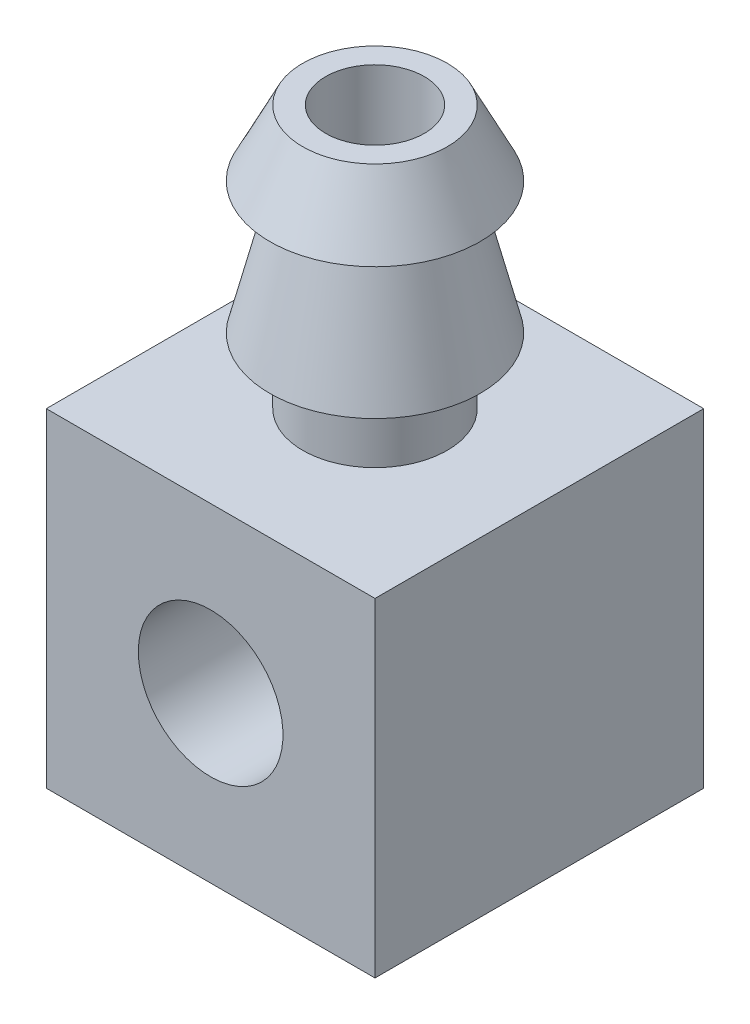
ISO-10303-21;
HEADER;
FILE_DESCRIPTION(('STEP AP214'),'2;1');
FILE_NAME('part.step','',(''),(''),'','','');
FILE_SCHEMA(('AUTOMOTIVE_DESIGN { 1 0 10303 214 1 1 1 1 }'));
ENDSEC;
DATA;
#1=APPLICATION_CONTEXT('core data for automotive mechanical design processes');
#2=APPLICATION_PROTOCOL_DEFINITION('international standard','automotive_design',2000,#1);
#3=PRODUCT_CONTEXT('',#1,'mechanical');
#4=PRODUCT('Part','Part','',(#3));
#5=PRODUCT_RELATED_PRODUCT_CATEGORY('part','',(#4));
#6=PRODUCT_DEFINITION_FORMATION('','',#4);
#7=PRODUCT_DEFINITION_CONTEXT('part definition',#1,'design');
#8=PRODUCT_DEFINITION('design','',#6,#7);
#9=PRODUCT_DEFINITION_SHAPE('','',#8);
#10=(LENGTH_UNIT() NAMED_UNIT(*) SI_UNIT(.MILLI.,.METRE.));
#11=(NAMED_UNIT(*) PLANE_ANGLE_UNIT() SI_UNIT($,.RADIAN.));
#12=(NAMED_UNIT(*) SI_UNIT($,.STERADIAN.) SOLID_ANGLE_UNIT());
#13=UNCERTAINTY_MEASURE_WITH_UNIT(LENGTH_MEASURE(1.E-05),#10,'distance_accuracy_value','');
#14=(GEOMETRIC_REPRESENTATION_CONTEXT(3) GLOBAL_UNCERTAINTY_ASSIGNED_CONTEXT((#13)) GLOBAL_UNIT_ASSIGNED_CONTEXT((#10,
#11,#12)) REPRESENTATION_CONTEXT('',''));
#15=CARTESIAN_POINT('',(0.,0.,0.));
#16=DIRECTION('',(0.,0.,1.));
#17=DIRECTION('',(1.,0.,0.));
#18=AXIS2_PLACEMENT_3D('',#15,#16,#17);
#19=CARTESIAN_POINT('',(2.5,-2.5,5.));
#20=DIRECTION('',(-1.,0.,0.));
#21=DIRECTION('',(0.,0.,1.));
#22=AXIS2_PLACEMENT_3D('',#19,#20,#21);
#23=PLANE('',#22);
#24=DIRECTION('',(0.,1.,0.));
#25=VECTOR('',#24,1.);
#26=CARTESIAN_POINT('',(2.5,-2.5,0.));
#27=LINE('',#26,#25);
#28=CARTESIAN_POINT('',(2.5,-2.5,0.));
#29=VERTEX_POINT('',#28);
#30=CARTESIAN_POINT('',(2.5,2.5,0.));
#31=VERTEX_POINT('',#30);
#32=EDGE_CURVE('E114',#29,#31,#27,.T.);
#33=ORIENTED_EDGE('',*,*,#32,.T.);
#34=DIRECTION('',(0.,0.,-1.));
#35=VECTOR('',#34,1.);
#36=CARTESIAN_POINT('',(2.5,2.5,5.));
#37=LINE('',#36,#35);
#38=CARTESIAN_POINT('',(2.5,2.5,5.));
#39=VERTEX_POINT('',#38);
#40=EDGE_CURVE('E11',#39,#31,#37,.T.);
#41=ORIENTED_EDGE('',*,*,#40,.F.);
#42=DIRECTION('',(0.,1.,0.));
#43=VECTOR('',#42,1.);
#44=CARTESIAN_POINT('',(2.5,-2.5,5.));
#45=LINE('',#44,#43);
#46=CARTESIAN_POINT('',(2.5,-2.5,5.));
#47=VERTEX_POINT('',#46);
#48=EDGE_CURVE('E97',#47,#39,#45,.T.);
#49=ORIENTED_EDGE('',*,*,#48,.F.);
#50=DIRECTION('',(0.,0.,-1.));
#51=VECTOR('',#50,1.);
#52=CARTESIAN_POINT('',(2.5,-2.5,5.));
#53=LINE('',#52,#51);
#54=EDGE_CURVE('E110',#47,#29,#53,.T.);
#55=ORIENTED_EDGE('',*,*,#54,.T.);
#56=EDGE_LOOP('',(#33,#41,#49,#55));
#57=FACE_BOUND('',#56,.T.);
#58=ADVANCED_FACE('F38',(#57),#23,.F.);
#59=CARTESIAN_POINT('',(-2.5,2.5,5.));
#60=DIRECTION('',(0.,-1.,0.));
#61=DIRECTION('',(0.,0.,-1.));
#62=AXIS2_PLACEMENT_3D('',#59,#60,#61);
#63=PLANE('',#62);
#64=CARTESIAN_POINT('',(0.,2.5,2.5));
#65=DIRECTION('',(0.,-1.,0.));
#66=DIRECTION('',(0.,0.,-1.));
#67=AXIS2_PLACEMENT_3D('',#64,#65,#66);
#68=CIRCLE('',#67,1.1);
#69=CARTESIAN_POINT('',(0.,2.5,1.4));
#70=VERTEX_POINT('',#69);
#71=EDGE_CURVE('E118',#70,#70,#68,.T.);
#72=ORIENTED_EDGE('',*,*,#71,.T.);
#73=EDGE_LOOP('',(#72));
#74=FACE_BOUND('',#73,.T.);
#75=DIRECTION('',(-1.,0.,0.));
#76=VECTOR('',#75,1.);
#77=CARTESIAN_POINT('',(-2.5,2.5,0.));
#78=LINE('',#77,#76);
#79=CARTESIAN_POINT('',(-2.5,2.5,0.));
#80=VERTEX_POINT('',#79);
#81=EDGE_CURVE('E102',#31,#80,#78,.T.);
#82=ORIENTED_EDGE('',*,*,#81,.T.);
#83=DIRECTION('',(0.,0.,-1.));
#84=VECTOR('',#83,1.);
#85=CARTESIAN_POINT('',(-2.5,2.5,5.));
#86=LINE('',#85,#84);
#87=CARTESIAN_POINT('',(-2.5,2.5,5.));
#88=VERTEX_POINT('',#87);
#89=EDGE_CURVE('E53',#88,#80,#86,.T.);
#90=ORIENTED_EDGE('',*,*,#89,.F.);
#91=DIRECTION('',(-1.,0.,0.));
#92=VECTOR('',#91,1.);
#93=CARTESIAN_POINT('',(-2.5,2.5,5.));
#94=LINE('',#93,#92);
#95=EDGE_CURVE('E92',#39,#88,#94,.T.);
#96=ORIENTED_EDGE('',*,*,#95,.F.);
#97=ORIENTED_EDGE('',*,*,#40,.T.);
#98=EDGE_LOOP('',(#82,#90,#96,#97));
#99=FACE_BOUND('',#98,.T.);
#100=ADVANCED_FACE('F101',(#74,#99),#63,.F.);
#101=CARTESIAN_POINT('',(-2.5,-2.5,5.));
#102=DIRECTION('',(1.,0.,0.));
#103=DIRECTION('',(0.,0.,-1.));
#104=AXIS2_PLACEMENT_3D('',#101,#102,#103);
#105=PLANE('',#104);
#106=DIRECTION('',(0.,-1.,0.));
#107=VECTOR('',#106,1.);
#108=CARTESIAN_POINT('',(-2.5,-2.5,0.));
#109=LINE('',#108,#107);
#110=CARTESIAN_POINT('',(-2.5,-2.5,0.));
#111=VERTEX_POINT('',#110);
#112=EDGE_CURVE('E79',#80,#111,#109,.T.);
#113=ORIENTED_EDGE('',*,*,#112,.T.);
#114=DIRECTION('',(0.,0.,-1.));
#115=VECTOR('',#114,1.);
#116=CARTESIAN_POINT('',(-2.5,-2.5,5.));
#117=LINE('',#116,#115);
#118=CARTESIAN_POINT('',(-2.5,-2.5,5.));
#119=VERTEX_POINT('',#118);
#120=EDGE_CURVE('E104',#119,#111,#117,.T.);
#121=ORIENTED_EDGE('',*,*,#120,.F.);
#122=DIRECTION('',(0.,-1.,0.));
#123=VECTOR('',#122,1.);
#124=CARTESIAN_POINT('',(-2.5,-2.5,5.));
#125=LINE('',#124,#123);
#126=EDGE_CURVE('E95',#88,#119,#125,.T.);
#127=ORIENTED_EDGE('',*,*,#126,.F.);
#128=ORIENTED_EDGE('',*,*,#89,.T.);
#129=EDGE_LOOP('',(#113,#121,#127,#128));
#130=FACE_BOUND('',#129,.T.);
#131=ADVANCED_FACE('F106',(#130),#105,.F.);
#132=CARTESIAN_POINT('',(-2.5,-2.5,5.));
#133=DIRECTION('',(0.,1.,0.));
#134=DIRECTION('',(0.,0.,1.));
#135=AXIS2_PLACEMENT_3D('',#132,#133,#134);
#136=PLANE('',#135);
#137=DIRECTION('',(1.,0.,0.));
#138=VECTOR('',#137,1.);
#139=CARTESIAN_POINT('',(-2.5,-2.5,0.));
#140=LINE('',#139,#138);
#141=EDGE_CURVE('E85',#111,#29,#140,.T.);
#142=ORIENTED_EDGE('',*,*,#141,.T.);
#143=ORIENTED_EDGE('',*,*,#54,.F.);
#144=DIRECTION('',(1.,0.,0.));
#145=VECTOR('',#144,1.);
#146=CARTESIAN_POINT('',(-2.5,-2.5,5.));
#147=LINE('',#146,#145);
#148=EDGE_CURVE('E62',#119,#47,#147,.T.);
#149=ORIENTED_EDGE('',*,*,#148,.F.);
#150=ORIENTED_EDGE('',*,*,#120,.T.);
#151=EDGE_LOOP('',(#142,#143,#149,#150));
#152=FACE_BOUND('',#151,.T.);
#153=ADVANCED_FACE('F173',(#152),#136,.F.);
#154=CARTESIAN_POINT('',(0.,0.,5.));
#155=DIRECTION('',(0.,0.,-1.));
#156=DIRECTION('',(-1.,0.,0.));
#157=AXIS2_PLACEMENT_3D('',#154,#155,#156);
#158=PLANE('',#157);
#159=CARTESIAN_POINT('',(0.,0.,5.));
#160=DIRECTION('',(0.,0.,-1.));
#161=DIRECTION('',(-1.,0.,0.));
#162=AXIS2_PLACEMENT_3D('',#159,#160,#161);
#163=CIRCLE('',#162,1.1);
#164=CARTESIAN_POINT('',(-1.1,0.,5.));
#165=VERTEX_POINT('',#164);
#166=EDGE_CURVE('E326',#165,#165,#163,.T.);
#167=ORIENTED_EDGE('',*,*,#166,.T.);
#168=EDGE_LOOP('',(#167));
#169=FACE_BOUND('',#168,.T.);
#170=ORIENTED_EDGE('',*,*,#48,.T.);
#171=ORIENTED_EDGE('',*,*,#95,.T.);
#172=ORIENTED_EDGE('',*,*,#126,.T.);
#173=ORIENTED_EDGE('',*,*,#148,.T.);
#174=EDGE_LOOP('',(#170,#171,#172,#173));
#175=FACE_BOUND('',#174,.T.);
#176=ADVANCED_FACE('F93',(#169,#175),#158,.F.);
#177=CARTESIAN_POINT('',(0.,0.,0.));
#178=DIRECTION('',(0.,0.,-1.));
#179=DIRECTION('',(-1.,0.,0.));
#180=AXIS2_PLACEMENT_3D('',#177,#178,#179);
#181=PLANE('',#180);
#182=CARTESIAN_POINT('',(0.,0.,0.));
#183=DIRECTION('',(0.,0.,-1.));
#184=DIRECTION('',(-1.,0.,0.));
#185=AXIS2_PLACEMENT_3D('',#182,#183,#184);
#186=CIRCLE('',#185,1.1);
#187=CARTESIAN_POINT('',(-1.1,0.,0.));
#188=VERTEX_POINT('',#187);
#189=EDGE_CURVE('E134',#188,#188,#186,.T.);
#190=ORIENTED_EDGE('',*,*,#189,.F.);
#191=EDGE_LOOP('',(#190));
#192=FACE_BOUND('',#191,.T.);
#193=ORIENTED_EDGE('',*,*,#32,.F.);
#194=ORIENTED_EDGE('',*,*,#141,.F.);
#195=ORIENTED_EDGE('',*,*,#112,.F.);
#196=ORIENTED_EDGE('',*,*,#81,.F.);
#197=EDGE_LOOP('',(#193,#194,#195,#196));
#198=FACE_BOUND('',#197,.T.);
#199=ADVANCED_FACE('F161',(#192,#198),#181,.T.);
#200=CARTESIAN_POINT('',(0.,2.5,2.5));
#201=DIRECTION('',(0.,-1.,0.));
#202=DIRECTION('',(0.,0.,-1.));
#203=AXIS2_PLACEMENT_3D('',#200,#201,#202);
#204=CYLINDRICAL_SURFACE('',#203,1.1);
#205=ORIENTED_EDGE('',*,*,#71,.F.);
#206=EDGE_LOOP('',(#205));
#207=FACE_BOUND('',#206,.T.);
#208=CARTESIAN_POINT('',(0.,3.5,2.5));
#209=DIRECTION('',(0.,-1.,0.));
#210=DIRECTION('',(0.,0.,-1.));
#211=AXIS2_PLACEMENT_3D('',#208,#209,#210);
#212=CIRCLE('',#211,1.1);
#213=CARTESIAN_POINT('',(0.,3.5,1.4));
#214=VERTEX_POINT('',#213);
#215=EDGE_CURVE('E294',#214,#214,#212,.T.);
#216=ORIENTED_EDGE('',*,*,#215,.T.);
#217=EDGE_LOOP('',(#216));
#218=FACE_BOUND('',#217,.T.);
#219=ADVANCED_FACE('F163',(#207,#218),#204,.T.);
#220=CARTESIAN_POINT('',(0.,3.5,3.6));
#221=DIRECTION('',(0.,1.,0.));
#222=DIRECTION('',(0.,0.,1.));
#223=AXIS2_PLACEMENT_3D('',#220,#221,#222);
#224=PLANE('',#223);
#225=ORIENTED_EDGE('',*,*,#215,.F.);
#226=EDGE_LOOP('',(#225));
#227=FACE_BOUND('',#226,.T.);
#228=CARTESIAN_POINT('',(0.,3.5,2.5));
#229=DIRECTION('',(0.,-1.,0.));
#230=DIRECTION('',(0.,0.,-1.));
#231=AXIS2_PLACEMENT_3D('',#228,#229,#230);
#232=CIRCLE('',#231,1.6);
#233=CARTESIAN_POINT('',(0.,3.5,0.900000000000001));
#234=VERTEX_POINT('',#233);
#235=EDGE_CURVE('E297',#234,#234,#232,.T.);
#236=ORIENTED_EDGE('',*,*,#235,.T.);
#237=EDGE_LOOP('',(#236));
#238=FACE_BOUND('',#237,.T.);
#239=ADVANCED_FACE('F170',(#227,#238),#224,.F.);
#240=CARTESIAN_POINT('',(0.,5.5,2.5));
#241=DIRECTION('',(0.,-1.,0.));
#242=DIRECTION('',(0.,0.,-1.));
#243=AXIS2_PLACEMENT_3D('',#240,#241,#242);
#244=CONICAL_SURFACE('',#243,1.1,0.244978663126864);
#245=ORIENTED_EDGE('',*,*,#235,.F.);
#246=EDGE_LOOP('',(#245));
#247=FACE_BOUND('',#246,.T.);
#248=CARTESIAN_POINT('',(0.,5.5,2.5));
#249=DIRECTION('',(0.,-1.,0.));
#250=DIRECTION('',(0.,0.,-1.));
#251=AXIS2_PLACEMENT_3D('',#248,#249,#250);
#252=CIRCLE('',#251,1.1);
#253=CARTESIAN_POINT('',(0.,5.5,1.4));
#254=VERTEX_POINT('',#253);
#255=EDGE_CURVE('E299',#254,#254,#252,.T.);
#256=ORIENTED_EDGE('',*,*,#255,.T.);
#257=EDGE_LOOP('',(#256));
#258=FACE_BOUND('',#257,.T.);
#259=ADVANCED_FACE('F246',(#247,#258),#244,.T.);
#260=CARTESIAN_POINT('',(0.,5.5,3.6));
#261=DIRECTION('',(0.,1.,0.));
#262=DIRECTION('',(0.,0.,1.));
#263=AXIS2_PLACEMENT_3D('',#260,#261,#262);
#264=PLANE('',#263);
#265=ORIENTED_EDGE('',*,*,#255,.F.);
#266=EDGE_LOOP('',(#265));
#267=FACE_BOUND('',#266,.T.);
#268=CARTESIAN_POINT('',(0.,5.5,2.5));
#269=DIRECTION('',(0.,-1.,0.));
#270=DIRECTION('',(0.,0.,-1.));
#271=AXIS2_PLACEMENT_3D('',#268,#269,#270);
#272=CIRCLE('',#271,1.6);
#273=CARTESIAN_POINT('',(0.,5.5,0.900000000000001));
#274=VERTEX_POINT('',#273);
#275=EDGE_CURVE('E305',#274,#274,#272,.T.);
#276=ORIENTED_EDGE('',*,*,#275,.T.);
#277=EDGE_LOOP('',(#276));
#278=FACE_BOUND('',#277,.T.);
#279=ADVANCED_FACE('F238',(#267,#278),#264,.F.);
#280=CARTESIAN_POINT('',(0.,6.5,2.5));
#281=DIRECTION('',(0.,-1.,0.));
#282=DIRECTION('',(0.,0.,-1.));
#283=AXIS2_PLACEMENT_3D('',#280,#281,#282);
#284=CONICAL_SURFACE('',#283,1.1,0.463647609000805);
#285=ORIENTED_EDGE('',*,*,#275,.F.);
#286=EDGE_LOOP('',(#285));
#287=FACE_BOUND('',#286,.T.);
#288=CARTESIAN_POINT('',(0.,6.5,2.5));
#289=DIRECTION('',(0.,-1.,0.));
#290=DIRECTION('',(0.,0.,-1.));
#291=AXIS2_PLACEMENT_3D('',#288,#289,#290);
#292=CIRCLE('',#291,1.1);
#293=CARTESIAN_POINT('',(0.,6.5,1.4));
#294=VERTEX_POINT('',#293);
#295=EDGE_CURVE('E317',#294,#294,#292,.T.);
#296=ORIENTED_EDGE('',*,*,#295,.T.);
#297=EDGE_LOOP('',(#296));
#298=FACE_BOUND('',#297,.T.);
#299=ADVANCED_FACE('F232',(#287,#298),#284,.T.);
#300=CARTESIAN_POINT('',(0.,6.5,3.6));
#301=DIRECTION('',(0.,-1.,0.));
#302=DIRECTION('',(0.,0.,-1.));
#303=AXIS2_PLACEMENT_3D('',#300,#301,#302);
#304=PLANE('',#303);
#305=CARTESIAN_POINT('',(0.,6.5,2.5));
#306=DIRECTION('',(0.,1.,0.));
#307=DIRECTION('',(0.,0.,1.));
#308=AXIS2_PLACEMENT_3D('',#305,#306,#307);
#309=CIRCLE('',#308,0.75);
#310=CARTESIAN_POINT('',(0.,6.5,3.25));
#311=VERTEX_POINT('',#310);
#312=EDGE_CURVE('E322',#311,#311,#309,.T.);
#313=ORIENTED_EDGE('',*,*,#312,.F.);
#314=EDGE_LOOP('',(#313));
#315=FACE_BOUND('',#314,.T.);
#316=ORIENTED_EDGE('',*,*,#295,.F.);
#317=EDGE_LOOP('',(#316));
#318=FACE_BOUND('',#317,.T.);
#319=ADVANCED_FACE('F210',(#315,#318),#304,.F.);
#320=CARTESIAN_POINT('',(0.,-1.5,2.5));
#321=DIRECTION('',(0.,1.,0.));
#322=DIRECTION('',(0.,0.,1.));
#323=AXIS2_PLACEMENT_3D('',#320,#321,#322);
#324=CYLINDRICAL_SURFACE('',#323,0.75);
#325=CARTESIAN_POINT('',(0.,1.1,3.25));
#326=CARTESIAN_POINT('',(-0.0374973618435636,1.09999938293257,3.24999938085178));
#327=CARTESIAN_POINT('',(-0.0750006983033402,1.0980656841688,3.24717158695474));
#328=CARTESIAN_POINT('',(-0.148809307319852,1.09052040847244,3.23603746242082));
#329=CARTESIAN_POINT('',(-0.185113791763276,1.08490646082127,3.22772760035938));
#330=CARTESIAN_POINT('',(-0.255339480227532,1.07055194303432,3.20614859177342));
#331=CARTESIAN_POINT('',(-0.289271346524591,1.06182660228419,3.1929035874333));
#332=CARTESIAN_POINT('',(-0.354280663545986,1.04194163845303,3.16202844433174));
#333=CARTESIAN_POINT('',(-0.385357777109188,1.03078172836065,3.14439778851151));
#334=CARTESIAN_POINT('',(-0.446815124010501,1.00575842595247,3.10359970810546));
#335=CARTESIAN_POINT('',(-0.476902425905368,0.991744667816341,3.0800852190035));
#336=CARTESIAN_POINT('',(-0.532979258672838,0.962772917104335,3.02903109089334));
#337=CARTESIAN_POINT('',(-0.558962666980862,0.947813559490814,3.00148555376525));
#338=CARTESIAN_POINT('',(-0.610512939998384,0.91561009893895,2.93785834631726));
#339=CARTESIAN_POINT('',(-0.63529418742601,0.898399088401743,2.90111875458135));
#340=CARTESIAN_POINT('',(-0.678319864138517,0.866372319671299,2.82304845447361));
#341=CARTESIAN_POINT('',(-0.696575511127502,0.851552475293575,2.78172578638737));
#342=CARTESIAN_POINT('',(-0.721266133434853,0.830635302613014,2.70808290883474));
#343=CARTESIAN_POINT('',(-0.72960363544879,0.823254885814258,2.67676907904842));
#344=CARTESIAN_POINT('',(-0.742190921414966,0.811927298608613,2.61274913340042));
#345=CARTESIAN_POINT('',(-0.746448129102549,0.807973894312688,2.58004565956924));
#346=CARTESIAN_POINT('',(-0.750603641026167,0.80411667724191,2.51395440870222));
#347=CARTESIAN_POINT('',(-0.750480991500712,0.804232331290621,2.48056410615158));
#348=CARTESIAN_POINT('',(-0.745833531000593,0.808542559338197,2.41435091856944));
#349=CARTESIAN_POINT('',(-0.741305538687807,0.812740081075134,2.38152846104459));
#350=CARTESIAN_POINT('',(-0.728518426307483,0.824213796265676,2.31910497038377));
#351=CARTESIAN_POINT('',(-0.720472367897711,0.831312859651301,2.28942557105893));
#352=CARTESIAN_POINT('',(-0.701074384206606,0.847735928983881,2.2318210125113));
#353=CARTESIAN_POINT('',(-0.689719890791399,0.85706166233805,2.20389723662011));
#354=CARTESIAN_POINT('',(-0.65766593076382,0.88208006420814,2.13673275965807));
#355=CARTESIAN_POINT('',(-0.635118465657243,0.898645977676744,2.0986941755742));
#356=CARTESIAN_POINT('',(-0.583971643099367,0.93269760499413,2.0273382511863));
#357=CARTESIAN_POINT('',(-0.555360942293804,0.950184996053266,1.99402995834866));
#358=CARTESIAN_POINT('',(-0.492209599084743,0.984394048040352,1.93237976245778));
#359=CARTESIAN_POINT('',(-0.457618338007022,1.00110748723771,1.90408480986919));
#360=CARTESIAN_POINT('',(-0.383173827118671,1.03188748645417,1.85371208007581));
#361=CARTESIAN_POINT('',(-0.343331707806251,1.04595949679029,1.83162145305169));
#362=CARTESIAN_POINT('',(-0.268573382676514,1.06725247983133,1.7988255701354));
#363=CARTESIAN_POINT('',(-0.234523086773839,1.07530066178602,1.78668198774372));
#364=CARTESIAN_POINT('',(-0.164462380506162,1.08821744574079,1.76735445786367));
#365=CARTESIAN_POINT('',(-0.12845331128258,1.09308819431815,1.7601671618713));
#366=CARTESIAN_POINT('',(-0.0553331890702316,1.09922166832937,1.75113456955453));
#367=CARTESIAN_POINT('',(-0.0182187915513196,1.10047201044958,1.74930760754571));
#368=CARTESIAN_POINT('',(0.055808232895074,1.09920683744994,1.75116345512362));
#369=CARTESIAN_POINT('',(0.0927208512470034,1.09669116350541,1.75484649708448));
#370=CARTESIAN_POINT('',(0.163220115870743,1.08837127901,1.76714876667512));
#371=CARTESIAN_POINT('',(0.196878595922589,1.08275268633104,1.77548965000533));
#372=CARTESIAN_POINT('',(0.262215184656329,1.06881253486933,1.79649322789004));
#373=CARTESIAN_POINT('',(0.293892928245902,1.06049047952137,1.80915671643146));
#374=CARTESIAN_POINT('',(0.35715929030599,1.0409703251607,1.83949641457592));
#375=CARTESIAN_POINT('',(0.388539064207745,1.02959571086496,1.85749200193139));
#376=CARTESIAN_POINT('',(0.447967975447976,1.00516618561658,1.8974152403509));
#377=CARTESIAN_POINT('',(0.476014584750746,0.992110014730549,1.91934584468377));
#378=CARTESIAN_POINT('',(0.532937948319461,0.962893559578316,1.970676523182));
#379=CARTESIAN_POINT('',(0.561163326072445,0.946580170247727,2.0007124899777));
#380=CARTESIAN_POINT('',(0.612422856901132,0.914251759511184,2.06510579756052));
#381=CARTESIAN_POINT('',(0.635454575556951,0.898236881238988,2.09946515313917));
#382=CARTESIAN_POINT('',(0.673102302748248,0.870290870981119,2.16724703358631));
#383=CARTESIAN_POINT('',(0.688436862469085,0.858100561863739,2.20016142052209));
#384=CARTESIAN_POINT('',(0.714372458333655,0.836634227228727,2.26868320649675));
#385=CARTESIAN_POINT('',(0.724982801844877,0.82735248222066,2.30428514728961));
#386=CARTESIAN_POINT('',(0.739545421296986,0.814341706818468,2.37137436647899));
#387=CARTESIAN_POINT('',(0.744315803914505,0.809942561492261,2.40255056509687));
#388=CARTESIAN_POINT('',(0.749873373236708,0.804801597921057,2.46554527712294));
#389=CARTESIAN_POINT('',(0.750664234847163,0.804056405433864,2.49736317067793));
#390=CARTESIAN_POINT('',(0.748212141010642,0.806337835265931,2.56068516752653));
#391=CARTESIAN_POINT('',(0.744970887674293,0.809362866030126,2.59218939757199));
#392=CARTESIAN_POINT('',(0.734675438431746,0.818717827707837,2.65407622635015));
#393=CARTESIAN_POINT('',(0.727615862952717,0.82505242098121,2.68445717784056));
#394=CARTESIAN_POINT('',(0.707241135554895,0.842640017333871,2.75289992335671));
#395=CARTESIAN_POINT('',(0.692652049680011,0.854815764504145,2.79034146989959));
#396=CARTESIAN_POINT('',(0.658192961696143,0.881622475206229,2.86174577345862));
#397=CARTESIAN_POINT('',(0.638314978832001,0.896257136749367,2.89570316480645));
#398=CARTESIAN_POINT('',(0.593296200743135,0.926689440661908,2.96052956989368));
#399=CARTESIAN_POINT('',(0.568055679713657,0.942504798184612,2.99132080790861));
#400=CARTESIAN_POINT('',(0.512874387785556,0.973634599055176,3.04867447533277));
#401=CARTESIAN_POINT('',(0.482932235256166,0.988948893556105,3.07523565705326));
#402=CARTESIAN_POINT('',(0.414411048575587,1.0197313005343,3.12676373683257));
#403=CARTESIAN_POINT('',(0.375214471319997,1.03495700287317,3.15106651776934));
#404=CARTESIAN_POINT('',(0.291954504051493,1.06144124439373,3.19239379316707));
#405=CARTESIAN_POINT('',(0.247901349505852,1.07270792509244,3.20943323985708));
#406=CARTESIAN_POINT('',(0.169645806462719,1.08734549400637,3.23134424367283));
#407=CARTESIAN_POINT('',(0.136270676276283,1.09205679624109,3.23830838913831));
#408=CARTESIAN_POINT('',(0.0685983594050022,1.09838349761991,3.24763531114469));
#409=CARTESIAN_POINT('',(0.0343016795260807,1.10000056447836,3.25000056638181));
#410=CARTESIAN_POINT('',(0.,1.1,3.25));
#411=B_SPLINE_CURVE_WITH_KNOTS('',3,(#325,#326,#327,#328,#329,#330,#331,#332,#333,#334,#335,
#336,#337,#338,#339,#340,#341,#342,#343,#344,#345,#346,#347,#348,#349,#350,#351,#352,#353,#354,
#355,#356,#357,#358,#359,#360,#361,#362,#363,#364,#365,#366,#367,#368,#369,#370,#371,#372,#373,
#374,#375,#376,#377,#378,#379,#380,#381,#382,#383,#384,#385,#386,#387,#388,#389,#390,#391,#392,
#393,#394,#395,#396,#397,#398,#399,#400,#401,#402,#403,#404,#405,#406,#407,#408,#409,#410),
.UNSPECIFIED.,.T.,.F.,(4,2,2,2,2,2,2,2,2,2,2,2,2,2,2,2,2,2,2,2,2,2,2,2,2,2,2,2,2,2,2,2,2,2,2,2,
2,2,2,2,2,2,4),(0.,0.112352468015475,0.224777381718619,0.336659395066204,0.44855460531749,
0.570131046152292,0.691887186659114,0.833861203882702,0.975589976300831,1.07490733941703,
1.17404365839753,1.27365432065537,1.37333697063597,1.46767510648812,1.56208666718933,
1.70301117589621,1.84420169700408,1.98665163874916,2.12880433850043,2.23944502840996,
2.35001089521817,2.46095449965005,2.57190278305312,2.67683801084222,2.78179252377765,
2.89512255466001,3.00853799934091,3.14099738200877,3.2735187237996,3.38801659153865,
3.50228787335799,3.59739783314269,3.69241994708702,3.78740196215474,3.88251814576755,
4.00780358923487,4.13327916677512,4.261332407572,4.38942334901493,4.53428595841715,
4.67884889776381,4.78168165749334,4.88445897734611),.UNSPECIFIED.);
#412=CARTESIAN_POINT('',(0.,1.1,3.25));
#413=VERTEX_POINT('',#412);
#414=EDGE_CURVE('E128',#413,#413,#411,.T.);
#415=ORIENTED_EDGE('',*,*,#414,.T.);
#416=EDGE_LOOP('',(#415));
#417=FACE_BOUND('',#416,.T.);
#418=ORIENTED_EDGE('',*,*,#312,.T.);
#419=EDGE_LOOP('',(#418));
#420=FACE_BOUND('',#419,.T.);
#421=ADVANCED_FACE('F135',(#417,#420),#324,.F.);
#422=CARTESIAN_POINT('',(0.,0.,8.));
#423=DIRECTION('',(0.,0.,-1.));
#424=DIRECTION('',(-1.,0.,0.));
#425=AXIS2_PLACEMENT_3D('',#422,#423,#424);
#426=CYLINDRICAL_SURFACE('',#425,1.1);
#427=CARTESIAN_POINT('',(0.,-1.1,3.25));
#428=CARTESIAN_POINT('',(0.0374973618435636,-1.09999938293257,3.24999938085178));
#429=CARTESIAN_POINT('',(0.0750006983033402,-1.0980656841688,3.24717158695474));
#430=CARTESIAN_POINT('',(0.148809307319852,-1.09052040847244,3.23603746242082));
#431=CARTESIAN_POINT('',(0.185113791763276,-1.08490646082127,3.22772760035938));
#432=CARTESIAN_POINT('',(0.255339480227532,-1.07055194303432,3.20614859177342));
#433=CARTESIAN_POINT('',(0.289271346524591,-1.06182660228419,3.1929035874333));
#434=CARTESIAN_POINT('',(0.354280663545986,-1.04194163845303,3.16202844433174));
#435=CARTESIAN_POINT('',(0.385357777109188,-1.03078172836065,3.14439778851151));
#436=CARTESIAN_POINT('',(0.446815124010501,-1.00575842595247,3.10359970810546));
#437=CARTESIAN_POINT('',(0.476902425905368,-0.991744667816341,3.0800852190035));
#438=CARTESIAN_POINT('',(0.532979258672838,-0.962772917104335,3.02903109089334));
#439=CARTESIAN_POINT('',(0.558962666980862,-0.947813559490814,3.00148555376525));
#440=CARTESIAN_POINT('',(0.610512939998384,-0.91561009893895,2.93785834631726));
#441=CARTESIAN_POINT('',(0.63529418742601,-0.898399088401743,2.90111875458135));
#442=CARTESIAN_POINT('',(0.678319864138517,-0.866372319671299,2.82304845447361));
#443=CARTESIAN_POINT('',(0.696575511127502,-0.851552475293575,2.78172578638737));
#444=CARTESIAN_POINT('',(0.721266133434853,-0.830635302613014,2.70808290883474));
#445=CARTESIAN_POINT('',(0.72960363544879,-0.823254885814258,2.67676907904842));
#446=CARTESIAN_POINT('',(0.742190921414966,-0.811927298608613,2.61274913340042));
#447=CARTESIAN_POINT('',(0.746448129102549,-0.807973894312688,2.58004565956924));
#448=CARTESIAN_POINT('',(0.750603641026167,-0.80411667724191,2.51395440870222));
#449=CARTESIAN_POINT('',(0.750480991500712,-0.804232331290621,2.48056410615158));
#450=CARTESIAN_POINT('',(0.745833531000593,-0.808542559338197,2.41435091856944));
#451=CARTESIAN_POINT('',(0.741305538687807,-0.812740081075134,2.38152846104459));
#452=CARTESIAN_POINT('',(0.728518426307483,-0.824213796265676,2.31910497038377));
#453=CARTESIAN_POINT('',(0.720472367897711,-0.831312859651301,2.28942557105893));
#454=CARTESIAN_POINT('',(0.701074384206606,-0.847735928983881,2.2318210125113));
#455=CARTESIAN_POINT('',(0.689719890791399,-0.85706166233805,2.20389723662011));
#456=CARTESIAN_POINT('',(0.65766593076382,-0.88208006420814,2.13673275965807));
#457=CARTESIAN_POINT('',(0.635118465657243,-0.898645977676744,2.0986941755742));
#458=CARTESIAN_POINT('',(0.583971643099367,-0.93269760499413,2.0273382511863));
#459=CARTESIAN_POINT('',(0.555360942293804,-0.950184996053266,1.99402995834866));
#460=CARTESIAN_POINT('',(0.492209599084743,-0.984394048040352,1.93237976245778));
#461=CARTESIAN_POINT('',(0.457618338007022,-1.00110748723771,1.90408480986919));
#462=CARTESIAN_POINT('',(0.383173827118671,-1.03188748645417,1.85371208007581));
#463=CARTESIAN_POINT('',(0.343331707806251,-1.04595949679029,1.83162145305169));
#464=CARTESIAN_POINT('',(0.268573382676514,-1.06725247983133,1.7988255701354));
#465=CARTESIAN_POINT('',(0.234523086773839,-1.07530066178602,1.78668198774372));
#466=CARTESIAN_POINT('',(0.164462380506162,-1.08821744574079,1.76735445786367));
#467=CARTESIAN_POINT('',(0.12845331128258,-1.09308819431815,1.7601671618713));
#468=CARTESIAN_POINT('',(0.0553331890702316,-1.09922166832937,1.75113456955453));
#469=CARTESIAN_POINT('',(0.0182187915513196,-1.10047201044958,1.74930760754571));
#470=CARTESIAN_POINT('',(-0.055808232895074,-1.09920683744994,1.75116345512362));
#471=CARTESIAN_POINT('',(-0.0927208512470034,-1.09669116350541,1.75484649708448));
#472=CARTESIAN_POINT('',(-0.163220115870743,-1.08837127901,1.76714876667512));
#473=CARTESIAN_POINT('',(-0.196878595922589,-1.08275268633104,1.77548965000533));
#474=CARTESIAN_POINT('',(-0.262215184656329,-1.06881253486933,1.79649322789004));
#475=CARTESIAN_POINT('',(-0.293892928245902,-1.06049047952137,1.80915671643146));
#476=CARTESIAN_POINT('',(-0.35715929030599,-1.0409703251607,1.83949641457592));
#477=CARTESIAN_POINT('',(-0.388539064207745,-1.02959571086496,1.85749200193139));
#478=CARTESIAN_POINT('',(-0.447967975447976,-1.00516618561658,1.8974152403509));
#479=CARTESIAN_POINT('',(-0.476014584750746,-0.992110014730549,1.91934584468377));
#480=CARTESIAN_POINT('',(-0.532937948319461,-0.962893559578316,1.970676523182));
#481=CARTESIAN_POINT('',(-0.561163326072445,-0.946580170247727,2.0007124899777));
#482=CARTESIAN_POINT('',(-0.612422856901132,-0.914251759511184,2.06510579756052));
#483=CARTESIAN_POINT('',(-0.635454575556951,-0.898236881238988,2.09946515313917));
#484=CARTESIAN_POINT('',(-0.673102302748248,-0.870290870981119,2.16724703358631));
#485=CARTESIAN_POINT('',(-0.688436862469085,-0.858100561863739,2.20016142052209));
#486=CARTESIAN_POINT('',(-0.714372458333655,-0.836634227228727,2.26868320649675));
#487=CARTESIAN_POINT('',(-0.724982801844877,-0.82735248222066,2.30428514728961));
#488=CARTESIAN_POINT('',(-0.739545421296986,-0.814341706818468,2.37137436647899));
#489=CARTESIAN_POINT('',(-0.744315803914505,-0.809942561492261,2.40255056509687));
#490=CARTESIAN_POINT('',(-0.749873373236708,-0.804801597921057,2.46554527712294));
#491=CARTESIAN_POINT('',(-0.750664234847163,-0.804056405433864,2.49736317067793));
#492=CARTESIAN_POINT('',(-0.748212141010642,-0.806337835265931,2.56068516752653));
#493=CARTESIAN_POINT('',(-0.744970887674293,-0.809362866030126,2.59218939757199));
#494=CARTESIAN_POINT('',(-0.734675438431746,-0.818717827707837,2.65407622635015));
#495=CARTESIAN_POINT('',(-0.727615862952717,-0.82505242098121,2.68445717784056));
#496=CARTESIAN_POINT('',(-0.707241135554895,-0.842640017333871,2.75289992335671));
#497=CARTESIAN_POINT('',(-0.692652049680011,-0.854815764504145,2.79034146989959));
#498=CARTESIAN_POINT('',(-0.658192961696143,-0.881622475206229,2.86174577345862));
#499=CARTESIAN_POINT('',(-0.638314978832001,-0.896257136749367,2.89570316480645));
#500=CARTESIAN_POINT('',(-0.593296200743135,-0.926689440661908,2.96052956989368));
#501=CARTESIAN_POINT('',(-0.568055679713657,-0.942504798184612,2.99132080790861));
#502=CARTESIAN_POINT('',(-0.512874387785556,-0.973634599055176,3.04867447533277));
#503=CARTESIAN_POINT('',(-0.482932235256166,-0.988948893556105,3.07523565705326));
#504=CARTESIAN_POINT('',(-0.414411048575587,-1.0197313005343,3.12676373683257));
#505=CARTESIAN_POINT('',(-0.375214471319997,-1.03495700287317,3.15106651776934));
#506=CARTESIAN_POINT('',(-0.291954504051493,-1.06144124439373,3.19239379316707));
#507=CARTESIAN_POINT('',(-0.247901349505852,-1.07270792509244,3.20943323985708));
#508=CARTESIAN_POINT('',(-0.169645806462719,-1.08734549400637,3.23134424367283));
#509=CARTESIAN_POINT('',(-0.136270676276283,-1.09205679624109,3.23830838913831));
#510=CARTESIAN_POINT('',(-0.0685983594050022,-1.09838349761991,3.24763531114469));
#511=CARTESIAN_POINT('',(-0.0343016795260807,-1.10000056447836,3.25000056638181));
#512=CARTESIAN_POINT('',(0.,-1.1,3.25));
#513=B_SPLINE_CURVE_WITH_KNOTS('',3,(#427,#428,#429,#430,#431,#432,#433,#434,#435,#436,#437,
#438,#439,#440,#441,#442,#443,#444,#445,#446,#447,#448,#449,#450,#451,#452,#453,#454,#455,#456,
#457,#458,#459,#460,#461,#462,#463,#464,#465,#466,#467,#468,#469,#470,#471,#472,#473,#474,#475,
#476,#477,#478,#479,#480,#481,#482,#483,#484,#485,#486,#487,#488,#489,#490,#491,#492,#493,#494,
#495,#496,#497,#498,#499,#500,#501,#502,#503,#504,#505,#506,#507,#508,#509,#510,#511,#512),
.UNSPECIFIED.,.T.,.F.,(4,2,2,2,2,2,2,2,2,2,2,2,2,2,2,2,2,2,2,2,2,2,2,2,2,2,2,2,2,2,2,2,2,2,2,2,
2,2,2,2,2,2,4),(0.,0.112352468015475,0.224777381718619,0.336659395066204,0.44855460531749,
0.570131046152292,0.691887186659114,0.833861203882702,0.975589976300831,1.07490733941703,
1.17404365839753,1.27365432065537,1.37333697063597,1.46767510648812,1.56208666718933,
1.70301117589621,1.84420169700408,1.98665163874916,2.12880433850043,2.23944502840996,
2.35001089521817,2.46095449965005,2.57190278305312,2.67683801084222,2.78179252377765,
2.89512255466001,3.00853799934091,3.14099738200877,3.2735187237996,3.38801659153865,
3.50228787335799,3.59739783314269,3.69241994708702,3.78740196215474,3.88251814576755,
4.00780358923487,4.13327916677512,4.261332407572,4.38942334901493,4.53428595841715,
4.67884889776381,4.78168165749334,4.88445897734611),.UNSPECIFIED.);
#514=CARTESIAN_POINT('',(0.,-1.1,3.25));
#515=VERTEX_POINT('',#514);
#516=EDGE_CURVE('E41',#515,#515,#513,.T.);
#517=ORIENTED_EDGE('',*,*,#516,.F.);
#518=EDGE_LOOP('',(#517));
#519=FACE_BOUND('',#518,.T.);
#520=ORIENTED_EDGE('',*,*,#189,.T.);
#521=EDGE_LOOP('',(#520));
#522=FACE_BOUND('',#521,.T.);
#523=ORIENTED_EDGE('',*,*,#414,.F.);
#524=EDGE_LOOP('',(#523));
#525=FACE_BOUND('',#524,.T.);
#526=ORIENTED_EDGE('',*,*,#166,.F.);
#527=EDGE_LOOP('',(#526));
#528=FACE_BOUND('',#527,.T.);
#529=ADVANCED_FACE('F139',(#519,#522,#525,#528),#426,.F.);
#530=CARTESIAN_POINT('',(0.,-1.5,2.5));
#531=DIRECTION('',(0.,1.,0.));
#532=DIRECTION('',(0.,0.,1.));
#533=AXIS2_PLACEMENT_3D('',#530,#531,#532);
#534=PLANE('',#533);
#535=CARTESIAN_POINT('',(0.,-1.5,2.5));
#536=DIRECTION('',(0.,1.,0.));
#537=DIRECTION('',(0.,0.,1.));
#538=AXIS2_PLACEMENT_3D('',#535,#536,#537);
#539=CIRCLE('',#538,0.75);
#540=CARTESIAN_POINT('',(0.,-1.5,3.25));
#541=VERTEX_POINT('',#540);
#542=EDGE_CURVE('E321',#541,#541,#539,.T.);
#543=ORIENTED_EDGE('',*,*,#542,.T.);
#544=EDGE_LOOP('',(#543));
#545=FACE_BOUND('',#544,.T.);
#546=ADVANCED_FACE('F142',(#545),#534,.T.);
#547=ORIENTED_EDGE('',*,*,#516,.T.);
#548=EDGE_LOOP('',(#547));
#549=FACE_BOUND('',#548,.T.);
#550=ORIENTED_EDGE('',*,*,#542,.F.);
#551=EDGE_LOOP('',(#550));
#552=FACE_BOUND('',#551,.T.);
#553=ADVANCED_FACE('F146',(#549,#552),#324,.F.);
#554=CLOSED_SHELL('',(#58,#100,#131,#153,#176,#199,#219,#239,#259,#279,#299,#319,#421,#529,#546,#553));
#555=MANIFOLD_SOLID_BREP('B2',#554);
#556=ADVANCED_BREP_SHAPE_REPRESENTATION('',(#18,#555),#14);
#557=SHAPE_DEFINITION_REPRESENTATION(#9,#556);
ENDSEC;
END-ISO-10303-21;
